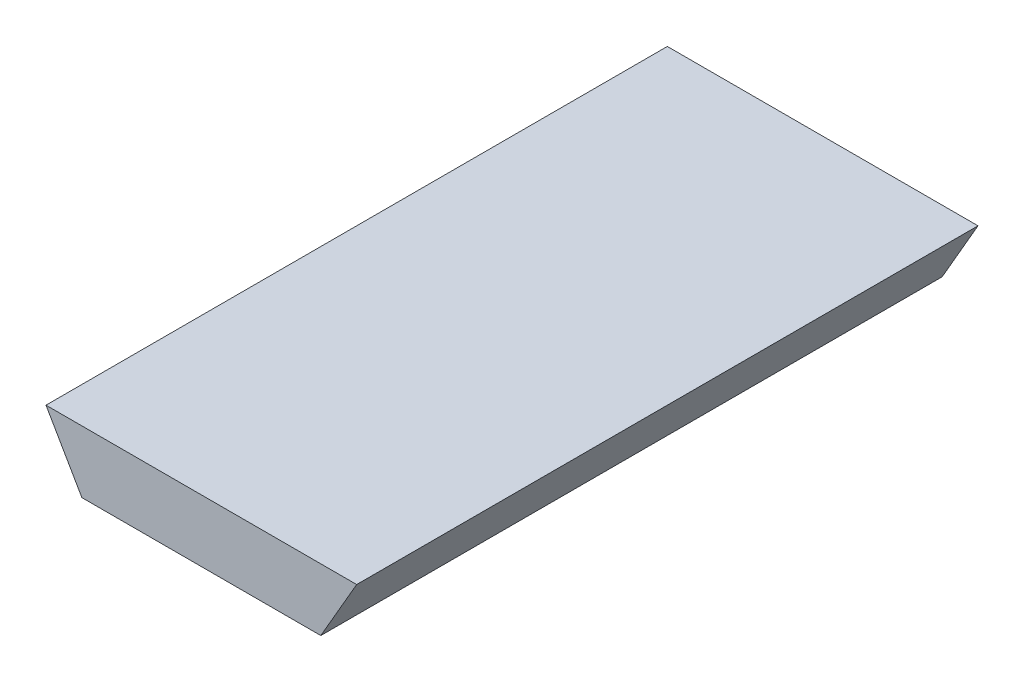
ISO-10303-21;
HEADER;
FILE_DESCRIPTION(('STEP AP214'),'2;1');
FILE_NAME('part.step','',(''),(''),'','','');
FILE_SCHEMA(('AUTOMOTIVE_DESIGN { 1 0 10303 214 1 1 1 1 }'));
ENDSEC;
DATA;
#1=APPLICATION_CONTEXT('core data for automotive mechanical design processes');
#2=APPLICATION_PROTOCOL_DEFINITION('international standard','automotive_design',2000,#1);
#3=PRODUCT_CONTEXT('',#1,'mechanical');
#4=PRODUCT('Part','Part','',(#3));
#5=PRODUCT_RELATED_PRODUCT_CATEGORY('part','',(#4));
#6=PRODUCT_DEFINITION_FORMATION('','',#4);
#7=PRODUCT_DEFINITION_CONTEXT('part definition',#1,'design');
#8=PRODUCT_DEFINITION('design','',#6,#7);
#9=PRODUCT_DEFINITION_SHAPE('','',#8);
#10=(LENGTH_UNIT() NAMED_UNIT(*) SI_UNIT(.MILLI.,.METRE.));
#11=(NAMED_UNIT(*) PLANE_ANGLE_UNIT() SI_UNIT($,.RADIAN.));
#12=(NAMED_UNIT(*) SI_UNIT($,.STERADIAN.) SOLID_ANGLE_UNIT());
#13=UNCERTAINTY_MEASURE_WITH_UNIT(LENGTH_MEASURE(1.E-05),#10,'distance_accuracy_value','');
#14=(GEOMETRIC_REPRESENTATION_CONTEXT(3) GLOBAL_UNCERTAINTY_ASSIGNED_CONTEXT((#13)) GLOBAL_UNIT_ASSIGNED_CONTEXT((#10,
#11,#12)) REPRESENTATION_CONTEXT('',''));
#15=CARTESIAN_POINT('',(0.,0.,0.));
#16=DIRECTION('',(0.,0.,1.));
#17=DIRECTION('',(1.,0.,0.));
#18=AXIS2_PLACEMENT_3D('',#15,#16,#17);
#19=CARTESIAN_POINT('',(0.,0.,5.));
#20=DIRECTION('',(0.,1.,0.));
#21=DIRECTION('',(0.,0.,1.));
#22=AXIS2_PLACEMENT_3D('',#19,#20,#21);
#23=PLANE('',#22);
#24=DIRECTION('',(1.,0.,0.));
#25=VECTOR('',#24,1.);
#26=CARTESIAN_POINT('',(0.,0.,0.));
#27=LINE('',#26,#25);
#28=CARTESIAN_POINT('',(-0.961324865405186,0.,0.));
#29=VERTEX_POINT('',#28);
#30=CARTESIAN_POINT('',(0.961324865405187,0.,0.));
#31=VERTEX_POINT('',#30);
#32=EDGE_CURVE('E96',#29,#31,#27,.T.);
#33=ORIENTED_EDGE('',*,*,#32,.T.);
#34=DIRECTION('',(0.,0.,-1.));
#35=VECTOR('',#34,1.);
#36=CARTESIAN_POINT('',(0.961324865405187,0.,5.));
#37=LINE('',#36,#35);
#38=CARTESIAN_POINT('',(0.961324865405187,0.,5.));
#39=VERTEX_POINT('',#38);
#40=EDGE_CURVE('E11',#39,#31,#37,.T.);
#41=ORIENTED_EDGE('',*,*,#40,.F.);
#42=DIRECTION('',(1.,0.,0.));
#43=VECTOR('',#42,1.);
#44=CARTESIAN_POINT('',(0.,0.,5.));
#45=LINE('',#44,#43);
#46=CARTESIAN_POINT('',(-0.961324865405186,0.,5.));
#47=VERTEX_POINT('',#46);
#48=EDGE_CURVE('E84',#47,#39,#45,.T.);
#49=ORIENTED_EDGE('',*,*,#48,.F.);
#50=DIRECTION('',(0.,0.,-1.));
#51=VECTOR('',#50,1.);
#52=CARTESIAN_POINT('',(-0.961324865405186,0.,5.));
#53=LINE('',#52,#51);
#54=EDGE_CURVE('E92',#47,#29,#53,.T.);
#55=ORIENTED_EDGE('',*,*,#54,.T.);
#56=EDGE_LOOP('',(#33,#41,#49,#55));
#57=FACE_BOUND('',#56,.T.);
#58=ADVANCED_FACE('F33',(#57),#23,.F.);
#59=CARTESIAN_POINT('',(0.72099364905389,-0.416265877365274,5.));
#60=DIRECTION('',(-0.866025403784439,0.5,0.));
#61=DIRECTION('',(-0.5,-0.866025403784439,0.));
#62=AXIS2_PLACEMENT_3D('',#59,#60,#61);
#63=PLANE('',#62);
#64=DIRECTION('',(0.5,0.866025403784439,0.));
#65=VECTOR('',#64,1.);
#66=CARTESIAN_POINT('',(0.72099364905389,-0.416265877365274,0.));
#67=LINE('',#66,#65);
#68=CARTESIAN_POINT('',(1.25,0.5,0.));
#69=VERTEX_POINT('',#68);
#70=EDGE_CURVE('E88',#31,#69,#67,.T.);
#71=ORIENTED_EDGE('',*,*,#70,.T.);
#72=DIRECTION('',(0.,0.,-1.));
#73=VECTOR('',#72,1.);
#74=CARTESIAN_POINT('',(1.25,0.5,5.));
#75=LINE('',#74,#73);
#76=CARTESIAN_POINT('',(1.25,0.5,5.));
#77=VERTEX_POINT('',#76);
#78=EDGE_CURVE('E41',#77,#69,#75,.T.);
#79=ORIENTED_EDGE('',*,*,#78,.F.);
#80=DIRECTION('',(0.5,0.866025403784439,0.));
#81=VECTOR('',#80,1.);
#82=CARTESIAN_POINT('',(0.72099364905389,-0.416265877365274,5.));
#83=LINE('',#82,#81);
#84=EDGE_CURVE('E79',#39,#77,#83,.T.);
#85=ORIENTED_EDGE('',*,*,#84,.F.);
#86=ORIENTED_EDGE('',*,*,#40,.T.);
#87=EDGE_LOOP('',(#71,#79,#85,#86));
#88=FACE_BOUND('',#87,.T.);
#89=ADVANCED_FACE('F87',(#88),#63,.F.);
#90=CARTESIAN_POINT('',(0.,0.500000000000001,5.));
#91=DIRECTION('',(0.,-1.,0.));
#92=DIRECTION('',(1.,0.,0.));
#93=AXIS2_PLACEMENT_3D('',#90,#91,#92);
#94=PLANE('',#93);
#95=DIRECTION('',(-1.,0.,0.));
#96=VECTOR('',#95,1.);
#97=CARTESIAN_POINT('',(0.,0.500000000000001,0.));
#98=LINE('',#97,#96);
#99=CARTESIAN_POINT('',(-1.25,0.500000000000001,0.));
#100=VERTEX_POINT('',#99);
#101=EDGE_CURVE('E66',#69,#100,#98,.T.);
#102=ORIENTED_EDGE('',*,*,#101,.T.);
#103=DIRECTION('',(0.,0.,-1.));
#104=VECTOR('',#103,1.);
#105=CARTESIAN_POINT('',(-1.25,0.500000000000001,5.));
#106=LINE('',#105,#104);
#107=CARTESIAN_POINT('',(-1.25,0.500000000000001,5.));
#108=VERTEX_POINT('',#107);
#109=EDGE_CURVE('E89',#108,#100,#106,.T.);
#110=ORIENTED_EDGE('',*,*,#109,.F.);
#111=DIRECTION('',(-1.,0.,0.));
#112=VECTOR('',#111,1.);
#113=CARTESIAN_POINT('',(0.,0.500000000000001,5.));
#114=LINE('',#113,#112);
#115=EDGE_CURVE('E82',#77,#108,#114,.T.);
#116=ORIENTED_EDGE('',*,*,#115,.F.);
#117=ORIENTED_EDGE('',*,*,#78,.T.);
#118=EDGE_LOOP('',(#102,#110,#116,#117));
#119=FACE_BOUND('',#118,.T.);
#120=ADVANCED_FACE('F90',(#119),#94,.F.);
#121=CARTESIAN_POINT('',(-0.72099364905389,-0.416265877365273,5.));
#122=DIRECTION('',(0.866025403784439,0.5,0.));
#123=DIRECTION('',(-0.5,0.866025403784439,0.));
#124=AXIS2_PLACEMENT_3D('',#121,#122,#123);
#125=PLANE('',#124);
#126=DIRECTION('',(0.5,-0.866025403784439,0.));
#127=VECTOR('',#126,1.);
#128=CARTESIAN_POINT('',(-0.72099364905389,-0.416265877365273,0.));
#129=LINE('',#128,#127);
#130=EDGE_CURVE('E72',#100,#29,#129,.T.);
#131=ORIENTED_EDGE('',*,*,#130,.T.);
#132=ORIENTED_EDGE('',*,*,#54,.F.);
#133=DIRECTION('',(0.5,-0.866025403784439,0.));
#134=VECTOR('',#133,1.);
#135=CARTESIAN_POINT('',(-0.72099364905389,-0.416265877365273,5.));
#136=LINE('',#135,#134);
#137=EDGE_CURVE('E49',#108,#47,#136,.T.);
#138=ORIENTED_EDGE('',*,*,#137,.F.);
#139=ORIENTED_EDGE('',*,*,#109,.T.);
#140=EDGE_LOOP('',(#131,#132,#138,#139));
#141=FACE_BOUND('',#140,.T.);
#142=ADVANCED_FACE('F103',(#141),#125,.F.);
#143=CARTESIAN_POINT('',(0.,0.,5.));
#144=DIRECTION('',(0.,0.,1.));
#145=DIRECTION('',(1.,0.,0.));
#146=AXIS2_PLACEMENT_3D('',#143,#144,#145);
#147=PLANE('',#146);
#148=ORIENTED_EDGE('',*,*,#48,.T.);
#149=ORIENTED_EDGE('',*,*,#84,.T.);
#150=ORIENTED_EDGE('',*,*,#115,.T.);
#151=ORIENTED_EDGE('',*,*,#137,.T.);
#152=EDGE_LOOP('',(#148,#149,#150,#151));
#153=FACE_BOUND('',#152,.T.);
#154=ADVANCED_FACE('F80',(#153),#147,.T.);
#155=CARTESIAN_POINT('',(0.,0.,0.));
#156=DIRECTION('',(0.,0.,1.));
#157=DIRECTION('',(1.,0.,0.));
#158=AXIS2_PLACEMENT_3D('',#155,#156,#157);
#159=PLANE('',#158);
#160=ORIENTED_EDGE('',*,*,#32,.F.);
#161=ORIENTED_EDGE('',*,*,#130,.F.);
#162=ORIENTED_EDGE('',*,*,#101,.F.);
#163=ORIENTED_EDGE('',*,*,#70,.F.);
#164=EDGE_LOOP('',(#160,#161,#162,#163));
#165=FACE_BOUND('',#164,.T.);
#166=ADVANCED_FACE('F106',(#165),#159,.F.);
#167=CLOSED_SHELL('',(#58,#89,#120,#142,#154,#166));
#168=MANIFOLD_SOLID_BREP('B2',#167);
#169=ADVANCED_BREP_SHAPE_REPRESENTATION('',(#18,#168),#14);
#170=SHAPE_DEFINITION_REPRESENTATION(#9,#169);
ENDSEC;
END-ISO-10303-21;
